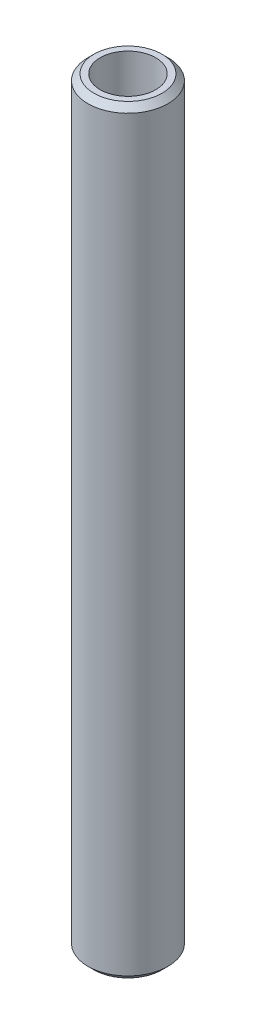
ISO-10303-21;
HEADER;
FILE_DESCRIPTION(('STEP AP214'),'2;1');
FILE_NAME('part.step','',(''),(''),'','','');
FILE_SCHEMA(('AUTOMOTIVE_DESIGN { 1 0 10303 214 1 1 1 1 }'));
ENDSEC;
DATA;
#1=APPLICATION_CONTEXT('core data for automotive mechanical design processes');
#2=APPLICATION_PROTOCOL_DEFINITION('international standard','automotive_design',2000,#1);
#3=PRODUCT_CONTEXT('',#1,'mechanical');
#4=PRODUCT('Part','Part','',(#3));
#5=PRODUCT_RELATED_PRODUCT_CATEGORY('part','',(#4));
#6=PRODUCT_DEFINITION_FORMATION('','',#4);
#7=PRODUCT_DEFINITION_CONTEXT('part definition',#1,'design');
#8=PRODUCT_DEFINITION('design','',#6,#7);
#9=PRODUCT_DEFINITION_SHAPE('','',#8);
#10=(LENGTH_UNIT() NAMED_UNIT(*) SI_UNIT(.MILLI.,.METRE.));
#11=(NAMED_UNIT(*) PLANE_ANGLE_UNIT() SI_UNIT($,.RADIAN.));
#12=(NAMED_UNIT(*) SI_UNIT($,.STERADIAN.) SOLID_ANGLE_UNIT());
#13=UNCERTAINTY_MEASURE_WITH_UNIT(LENGTH_MEASURE(1.E-05),#10,'distance_accuracy_value','');
#14=(GEOMETRIC_REPRESENTATION_CONTEXT(3) GLOBAL_UNCERTAINTY_ASSIGNED_CONTEXT((#13)) GLOBAL_UNIT_ASSIGNED_CONTEXT((#10,
#11,#12)) REPRESENTATION_CONTEXT('',''));
#15=CARTESIAN_POINT('',(0.,0.,0.));
#16=DIRECTION('',(0.,0.,1.));
#17=DIRECTION('',(1.,0.,0.));
#18=AXIS2_PLACEMENT_3D('',#15,#16,#17);
#19=CARTESIAN_POINT('',(0.,569.86111231383,0.));
#20=DIRECTION('',(0.,-1.,0.));
#21=DIRECTION('',(0.,0.,-1.));
#22=AXIS2_PLACEMENT_3D('',#19,#20,#21);
#23=CYLINDRICAL_SURFACE('',#22,30.);
#24=CARTESIAN_POINT('',(0.,565.342329350497,0.));
#25=DIRECTION('',(0.,1.,0.));
#26=DIRECTION('',(0.,0.,1.));
#27=AXIS2_PLACEMENT_3D('',#24,#25,#26);
#28=CIRCLE('',#27,30.);
#29=CARTESIAN_POINT('',(0.,565.342329350497,30.));
#30=VERTEX_POINT('',#29);
#31=EDGE_CURVE('E50',#30,#30,#28,.F.);
#32=ORIENTED_EDGE('',*,*,#31,.T.);
#33=EDGE_LOOP('',(#32));
#34=FACE_BOUND('',#33,.T.);
#35=CARTESIAN_POINT('',(0.,4.51878296333275,0.));
#36=DIRECTION('',(0.,1.,0.));
#37=DIRECTION('',(0.,0.,1.));
#38=AXIS2_PLACEMENT_3D('',#35,#36,#37);
#39=CIRCLE('',#38,30.);
#40=CARTESIAN_POINT('',(0.,4.51878296333275,30.));
#41=VERTEX_POINT('',#40);
#42=EDGE_CURVE('E51',#41,#41,#39,.T.);
#43=ORIENTED_EDGE('',*,*,#42,.T.);
#44=EDGE_LOOP('',(#43));
#45=FACE_BOUND('',#44,.T.);
#46=ADVANCED_FACE('F39',(#34,#45),#23,.T.);
#47=CARTESIAN_POINT('',(0.,569.86111231383,0.));
#48=DIRECTION('',(0.,1.,0.));
#49=DIRECTION('',(0.,0.,1.));
#50=AXIS2_PLACEMENT_3D('',#47,#48,#49);
#51=PLANE('',#50);
#52=CARTESIAN_POINT('',(0.,569.86111231383,0.));
#53=DIRECTION('',(0.,1.,0.));
#54=DIRECTION('',(0.,0.,1.));
#55=AXIS2_PLACEMENT_3D('',#52,#53,#54);
#56=CIRCLE('',#55,25.481217036667);
#57=CARTESIAN_POINT('',(0.,569.86111231383,25.481217036667));
#58=VERTEX_POINT('',#57);
#59=EDGE_CURVE('E54',#58,#58,#56,.T.);
#60=ORIENTED_EDGE('',*,*,#59,.T.);
#61=EDGE_LOOP('',(#60));
#62=FACE_BOUND('',#61,.T.);
#63=CARTESIAN_POINT('',(0.,569.86111231383,0.));
#64=DIRECTION('',(0.,1.,0.));
#65=DIRECTION('',(0.,0.,1.));
#66=AXIS2_PLACEMENT_3D('',#63,#64,#65);
#67=CIRCLE('',#66,20.8417644765151);
#68=CARTESIAN_POINT('',(0.,569.86111231383,20.8417644765151));
#69=VERTEX_POINT('',#68);
#70=EDGE_CURVE('E58',#69,#69,#67,.T.);
#71=ORIENTED_EDGE('',*,*,#70,.F.);
#72=EDGE_LOOP('',(#71));
#73=FACE_BOUND('',#72,.T.);
#74=ADVANCED_FACE('F69',(#62,#73),#51,.T.);
#75=CARTESIAN_POINT('',(0.,0.,0.));
#76=DIRECTION('',(0.,1.,0.));
#77=DIRECTION('',(0.,0.,1.));
#78=AXIS2_PLACEMENT_3D('',#75,#76,#77);
#79=PLANE('',#78);
#80=CARTESIAN_POINT('',(0.,0.,0.));
#81=DIRECTION('',(0.,1.,0.));
#82=DIRECTION('',(0.,0.,1.));
#83=AXIS2_PLACEMENT_3D('',#80,#81,#82);
#84=CIRCLE('',#83,25.4812170366672);
#85=CARTESIAN_POINT('',(0.,0.,25.4812170366672));
#86=VERTEX_POINT('',#85);
#87=EDGE_CURVE('E10',#86,#86,#84,.F.);
#88=ORIENTED_EDGE('',*,*,#87,.T.);
#89=EDGE_LOOP('',(#88));
#90=FACE_BOUND('',#89,.T.);
#91=CARTESIAN_POINT('',(0.,0.,0.));
#92=DIRECTION('',(0.,1.,0.));
#93=DIRECTION('',(0.,0.,1.));
#94=AXIS2_PLACEMENT_3D('',#91,#92,#93);
#95=CIRCLE('',#94,20.8417644765151);
#96=CARTESIAN_POINT('',(0.,0.,20.8417644765151));
#97=VERTEX_POINT('',#96);
#98=EDGE_CURVE('E63',#97,#97,#95,.T.);
#99=ORIENTED_EDGE('',*,*,#98,.T.);
#100=EDGE_LOOP('',(#99));
#101=FACE_BOUND('',#100,.T.);
#102=ADVANCED_FACE('F75',(#90,#101),#79,.F.);
#103=CARTESIAN_POINT('',(0.,569.86111231383,0.));
#104=DIRECTION('',(0.,-1.,0.));
#105=DIRECTION('',(0.,0.,-1.));
#106=AXIS2_PLACEMENT_3D('',#103,#104,#105);
#107=CYLINDRICAL_SURFACE('',#106,20.8417644765151);
#108=ORIENTED_EDGE('',*,*,#70,.T.);
#109=EDGE_LOOP('',(#108));
#110=FACE_BOUND('',#109,.T.);
#111=ORIENTED_EDGE('',*,*,#98,.F.);
#112=EDGE_LOOP('',(#111));
#113=FACE_BOUND('',#112,.T.);
#114=ADVANCED_FACE('F70',(#110,#113),#107,.F.);
#115=CARTESIAN_POINT('',(0.,569.86111231383,0.));
#116=DIRECTION('',(0.,-1.,0.));
#117=DIRECTION('',(0.,0.,-1.));
#118=AXIS2_PLACEMENT_3D('',#115,#116,#117);
#119=CONICAL_SURFACE('',#118,25.481217036667,0.785398163397451);
#120=ORIENTED_EDGE('',*,*,#31,.F.);
#121=EDGE_LOOP('',(#120));
#122=FACE_BOUND('',#121,.T.);
#123=ORIENTED_EDGE('',*,*,#59,.F.);
#124=EDGE_LOOP('',(#123));
#125=FACE_BOUND('',#124,.T.);
#126=ADVANCED_FACE('F81',(#122,#125),#119,.T.);
#127=CARTESIAN_POINT('',(0.,4.51878296333275,0.));
#128=DIRECTION('',(0.,1.,0.));
#129=DIRECTION('',(0.,0.,1.));
#130=AXIS2_PLACEMENT_3D('',#127,#128,#129);
#131=CONICAL_SURFACE('',#130,30.,0.785398163397451);
#132=ORIENTED_EDGE('',*,*,#87,.F.);
#133=EDGE_LOOP('',(#132));
#134=FACE_BOUND('',#133,.T.);
#135=ORIENTED_EDGE('',*,*,#42,.F.);
#136=EDGE_LOOP('',(#135));
#137=FACE_BOUND('',#136,.T.);
#138=ADVANCED_FACE('F45',(#134,#137),#131,.T.);
#139=CLOSED_SHELL('',(#46,#74,#102,#114,#126,#138));
#140=MANIFOLD_SOLID_BREP('B2',#139);
#141=ADVANCED_BREP_SHAPE_REPRESENTATION('',(#18,#140),#14);
#142=SHAPE_DEFINITION_REPRESENTATION(#9,#141);
ENDSEC;
END-ISO-10303-21;
